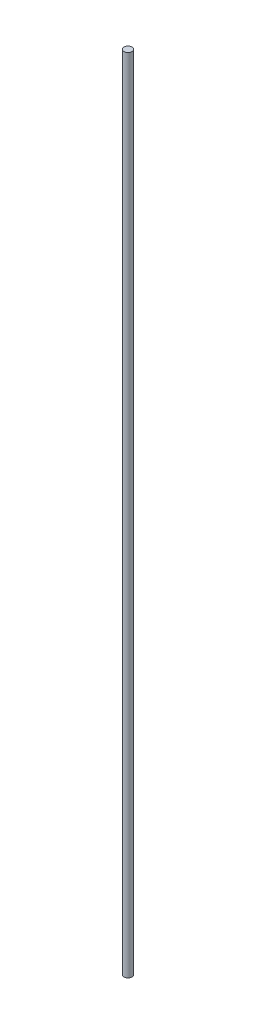
ISO-10303-21;
HEADER;
FILE_DESCRIPTION(('STEP AP214'),'2;1');
FILE_NAME('part.step','',(''),(''),'','','');
FILE_SCHEMA(('AUTOMOTIVE_DESIGN { 1 0 10303 214 1 1 1 1 }'));
ENDSEC;
DATA;
#1=APPLICATION_CONTEXT('core data for automotive mechanical design processes');
#2=APPLICATION_PROTOCOL_DEFINITION('international standard','automotive_design',2000,#1);
#3=PRODUCT_CONTEXT('',#1,'mechanical');
#4=PRODUCT('Part','Part','',(#3));
#5=PRODUCT_RELATED_PRODUCT_CATEGORY('part','',(#4));
#6=PRODUCT_DEFINITION_FORMATION('','',#4);
#7=PRODUCT_DEFINITION_CONTEXT('part definition',#1,'design');
#8=PRODUCT_DEFINITION('design','',#6,#7);
#9=PRODUCT_DEFINITION_SHAPE('','',#8);
#10=(LENGTH_UNIT() NAMED_UNIT(*) SI_UNIT(.MILLI.,.METRE.));
#11=(NAMED_UNIT(*) PLANE_ANGLE_UNIT() SI_UNIT($,.RADIAN.));
#12=(NAMED_UNIT(*) SI_UNIT($,.STERADIAN.) SOLID_ANGLE_UNIT());
#13=UNCERTAINTY_MEASURE_WITH_UNIT(LENGTH_MEASURE(1.E-05),#10,'distance_accuracy_value','');
#14=(GEOMETRIC_REPRESENTATION_CONTEXT(3) GLOBAL_UNCERTAINTY_ASSIGNED_CONTEXT((#13)) GLOBAL_UNIT_ASSIGNED_CONTEXT((#10,
#11,#12)) REPRESENTATION_CONTEXT('',''));
#15=CARTESIAN_POINT('',(0.,0.,0.));
#16=DIRECTION('',(0.,0.,1.));
#17=DIRECTION('',(1.,0.,0.));
#18=AXIS2_PLACEMENT_3D('',#15,#16,#17);
#19=CARTESIAN_POINT('',(-6.87719298245615,800.,-1.43859649122807));
#20=DIRECTION('',(0.,-1.,0.));
#21=DIRECTION('',(0.,0.,-1.));
#22=AXIS2_PLACEMENT_3D('',#19,#20,#21);
#23=CYLINDRICAL_SURFACE('',#22,4.);
#24=CARTESIAN_POINT('',(-6.87719298245615,800.,-1.43859649122807));
#25=DIRECTION('',(0.,1.,0.));
#26=DIRECTION('',(0.,0.,1.));
#27=AXIS2_PLACEMENT_3D('',#24,#25,#26);
#28=CIRCLE('',#27,4.);
#29=CARTESIAN_POINT('',(-6.87719298245615,800.,2.56140350877193));
#30=VERTEX_POINT('',#29);
#31=EDGE_CURVE('E10',#30,#30,#28,.T.);
#32=ORIENTED_EDGE('',*,*,#31,.F.);
#33=EDGE_LOOP('',(#32));
#34=FACE_BOUND('',#33,.T.);
#35=CARTESIAN_POINT('',(-6.87719298245615,0.,-1.43859649122807));
#36=DIRECTION('',(0.,1.,0.));
#37=DIRECTION('',(0.,0.,1.));
#38=AXIS2_PLACEMENT_3D('',#35,#36,#37);
#39=CIRCLE('',#38,4.);
#40=CARTESIAN_POINT('',(-6.87719298245615,0.,2.56140350877193));
#41=VERTEX_POINT('',#40);
#42=EDGE_CURVE('E34',#41,#41,#39,.T.);
#43=ORIENTED_EDGE('',*,*,#42,.T.);
#44=EDGE_LOOP('',(#43));
#45=FACE_BOUND('',#44,.T.);
#46=ADVANCED_FACE('F31',(#34,#45),#23,.T.);
#47=CARTESIAN_POINT('',(-6.87719298245615,800.,-1.43859649122807));
#48=DIRECTION('',(0.,1.,0.));
#49=DIRECTION('',(0.,0.,1.));
#50=AXIS2_PLACEMENT_3D('',#47,#48,#49);
#51=PLANE('',#50);
#52=ORIENTED_EDGE('',*,*,#31,.T.);
#53=EDGE_LOOP('',(#52));
#54=FACE_BOUND('',#53,.T.);
#55=ADVANCED_FACE('F46',(#54),#51,.T.);
#56=CARTESIAN_POINT('',(-6.87719298245615,0.,-1.43859649122807));
#57=DIRECTION('',(0.,1.,0.));
#58=DIRECTION('',(0.,0.,1.));
#59=AXIS2_PLACEMENT_3D('',#56,#57,#58);
#60=PLANE('',#59);
#61=ORIENTED_EDGE('',*,*,#42,.F.);
#62=EDGE_LOOP('',(#61));
#63=FACE_BOUND('',#62,.T.);
#64=ADVANCED_FACE('F44',(#63),#60,.F.);
#65=CLOSED_SHELL('',(#46,#55,#64));
#66=MANIFOLD_SOLID_BREP('B2',#65);
#67=ADVANCED_BREP_SHAPE_REPRESENTATION('',(#18,#66),#14);
#68=SHAPE_DEFINITION_REPRESENTATION(#9,#67);
ENDSEC;
END-ISO-10303-21;
